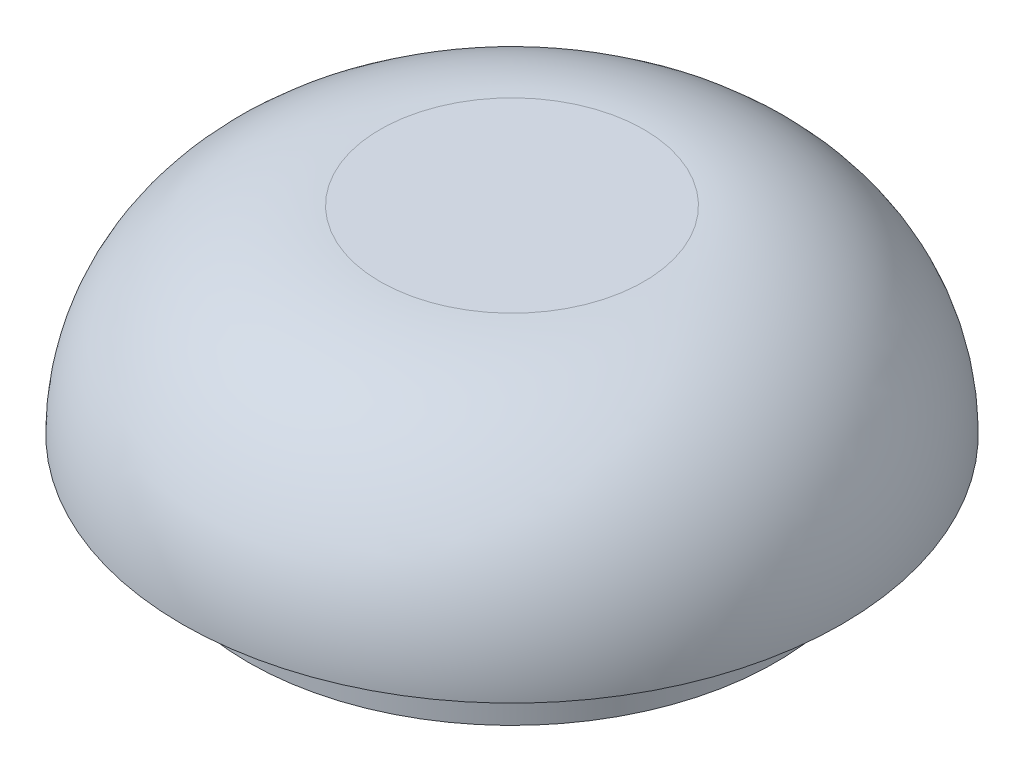
ISO-10303-21;
HEADER;
FILE_DESCRIPTION(('STEP AP214'),'2;1');
FILE_NAME('part.step','',(''),(''),'','','');
FILE_SCHEMA(('AUTOMOTIVE_DESIGN { 1 0 10303 214 1 1 1 1 }'));
ENDSEC;
DATA;
#1=APPLICATION_CONTEXT('core data for automotive mechanical design processes');
#2=APPLICATION_PROTOCOL_DEFINITION('international standard','automotive_design',2000,#1);
#3=PRODUCT_CONTEXT('',#1,'mechanical');
#4=PRODUCT('Part','Part','',(#3));
#5=PRODUCT_RELATED_PRODUCT_CATEGORY('part','',(#4));
#6=PRODUCT_DEFINITION_FORMATION('','',#4);
#7=PRODUCT_DEFINITION_CONTEXT('part definition',#1,'design');
#8=PRODUCT_DEFINITION('design','',#6,#7);
#9=PRODUCT_DEFINITION_SHAPE('','',#8);
#10=(LENGTH_UNIT() NAMED_UNIT(*) SI_UNIT(.MILLI.,.METRE.));
#11=(NAMED_UNIT(*) PLANE_ANGLE_UNIT() SI_UNIT($,.RADIAN.));
#12=(NAMED_UNIT(*) SI_UNIT($,.STERADIAN.) SOLID_ANGLE_UNIT());
#13=UNCERTAINTY_MEASURE_WITH_UNIT(LENGTH_MEASURE(1.E-05),#10,'distance_accuracy_value','');
#14=(GEOMETRIC_REPRESENTATION_CONTEXT(3) GLOBAL_UNCERTAINTY_ASSIGNED_CONTEXT((#13)) GLOBAL_UNIT_ASSIGNED_CONTEXT((#10,
#11,#12)) REPRESENTATION_CONTEXT('',''));
#15=CARTESIAN_POINT('',(0.,0.,0.));
#16=DIRECTION('',(0.,0.,1.));
#17=DIRECTION('',(1.,0.,0.));
#18=AXIS2_PLACEMENT_3D('',#15,#16,#17);
#19=CARTESIAN_POINT('',(0.,3.,0.));
#20=DIRECTION('',(0.,1.,0.));
#21=DIRECTION('',(0.,0.,1.));
#22=AXIS2_PLACEMENT_3D('',#19,#20,#21);
#23=PLANE('',#22);
#24=CARTESIAN_POINT('',(0.,3.,0.));
#25=DIRECTION('',(0.,1.,0.));
#26=DIRECTION('',(0.,0.,1.));
#27=AXIS2_PLACEMENT_3D('',#24,#25,#26);
#28=CIRCLE('',#27,2.);
#29=CARTESIAN_POINT('',(0.,3.,2.));
#30=VERTEX_POINT('',#29);
#31=EDGE_CURVE('E10',#30,#30,#28,.T.);
#32=ORIENTED_EDGE('',*,*,#31,.T.);
#33=EDGE_LOOP('',(#32));
#34=FACE_BOUND('',#33,.T.);
#35=ADVANCED_FACE('F37',(#34),#23,.T.);
#36=CARTESIAN_POINT('',(0.,0.,0.));
#37=DIRECTION('',(0.,1.,0.));
#38=DIRECTION('',(0.,0.,1.));
#39=AXIS2_PLACEMENT_3D('',#36,#37,#38);
#40=PLANE('',#39);
#41=CARTESIAN_POINT('',(0.,0.,0.));
#42=DIRECTION('',(0.,-1.,0.));
#43=DIRECTION('',(0.,0.,-1.));
#44=AXIS2_PLACEMENT_3D('',#41,#42,#43);
#45=CIRCLE('',#44,4.);
#46=CARTESIAN_POINT('',(0.,0.,-4.));
#47=VERTEX_POINT('',#46);
#48=EDGE_CURVE('E45',#47,#47,#45,.T.);
#49=ORIENTED_EDGE('',*,*,#48,.F.);
#50=EDGE_LOOP('',(#49));
#51=FACE_BOUND('',#50,.T.);
#52=CARTESIAN_POINT('',(0.,0.,0.));
#53=DIRECTION('',(0.,1.,0.));
#54=DIRECTION('',(0.,0.,1.));
#55=AXIS2_PLACEMENT_3D('',#52,#53,#54);
#56=CIRCLE('',#55,5.);
#57=CARTESIAN_POINT('',(0.,0.,5.));
#58=VERTEX_POINT('',#57);
#59=EDGE_CURVE('E50',#58,#58,#56,.T.);
#60=ORIENTED_EDGE('',*,*,#59,.F.);
#61=EDGE_LOOP('',(#60));
#62=FACE_BOUND('',#61,.T.);
#63=ADVANCED_FACE('F66',(#51,#62),#40,.F.);
#64=CARTESIAN_POINT('',(0.,-1.,0.));
#65=DIRECTION('',(0.,1.,0.));
#66=DIRECTION('',(0.,0.,1.));
#67=AXIS2_PLACEMENT_3D('',#64,#65,#66);
#68=CYLINDRICAL_SURFACE('',#67,4.);
#69=CARTESIAN_POINT('',(0.,-1.,0.));
#70=DIRECTION('',(0.,-1.,0.));
#71=DIRECTION('',(0.,0.,-1.));
#72=AXIS2_PLACEMENT_3D('',#69,#70,#71);
#73=CIRCLE('',#72,4.);
#74=CARTESIAN_POINT('',(0.,-1.,-4.));
#75=VERTEX_POINT('',#74);
#76=EDGE_CURVE('E56',#75,#75,#73,.T.);
#77=ORIENTED_EDGE('',*,*,#76,.F.);
#78=EDGE_LOOP('',(#77));
#79=FACE_BOUND('',#78,.T.);
#80=ORIENTED_EDGE('',*,*,#48,.T.);
#81=EDGE_LOOP('',(#80));
#82=FACE_BOUND('',#81,.T.);
#83=ADVANCED_FACE('F64',(#79,#82),#68,.T.);
#84=CARTESIAN_POINT('',(0.,-1.,0.));
#85=DIRECTION('',(0.,-1.,0.));
#86=DIRECTION('',(0.,0.,-1.));
#87=AXIS2_PLACEMENT_3D('',#84,#85,#86);
#88=PLANE('',#87);
#89=ORIENTED_EDGE('',*,*,#76,.T.);
#90=EDGE_LOOP('',(#89));
#91=FACE_BOUND('',#90,.T.);
#92=ADVANCED_FACE('F62',(#91),#88,.T.);
#93=CARTESIAN_POINT('',(0.,0.,0.));
#94=DIRECTION('',(0.,1.,0.));
#95=DIRECTION('',(0.,0.,1.));
#96=AXIS2_PLACEMENT_3D('',#93,#94,#95);
#97=DEGENERATE_TOROIDAL_SURFACE('',#96,2.,3.,.T.);
#98=ORIENTED_EDGE('',*,*,#59,.T.);
#99=EDGE_LOOP('',(#98));
#100=FACE_BOUND('',#99,.T.);
#101=ORIENTED_EDGE('',*,*,#31,.F.);
#102=EDGE_LOOP('',(#101));
#103=FACE_BOUND('',#102,.T.);
#104=ADVANCED_FACE('F39',(#100,#103),#97,.T.);
#105=CLOSED_SHELL('',(#35,#63,#83,#92,#104));
#106=MANIFOLD_SOLID_BREP('B2',#105);
#107=ADVANCED_BREP_SHAPE_REPRESENTATION('',(#18,#106),#14);
#108=SHAPE_DEFINITION_REPRESENTATION(#9,#107);
ENDSEC;
END-ISO-10303-21;
